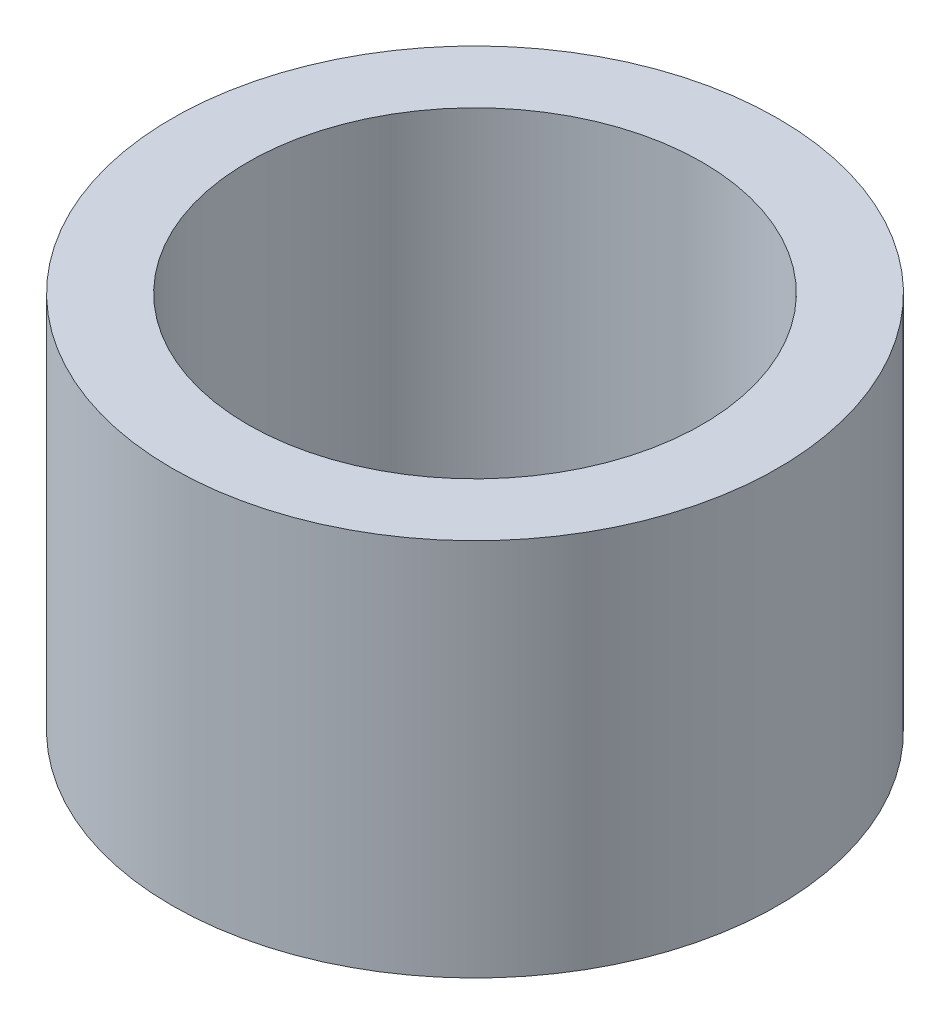
ISO-10303-21;
HEADER;
FILE_DESCRIPTION(('STEP AP214'),'2;1');
FILE_NAME('part.step','',(''),(''),'','','');
FILE_SCHEMA(('AUTOMOTIVE_DESIGN { 1 0 10303 214 1 1 1 1 }'));
ENDSEC;
DATA;
#1=APPLICATION_CONTEXT('core data for automotive mechanical design processes');
#2=APPLICATION_PROTOCOL_DEFINITION('international standard','automotive_design',2000,#1);
#3=PRODUCT_CONTEXT('',#1,'mechanical');
#4=PRODUCT('Part','Part','',(#3));
#5=PRODUCT_RELATED_PRODUCT_CATEGORY('part','',(#4));
#6=PRODUCT_DEFINITION_FORMATION('','',#4);
#7=PRODUCT_DEFINITION_CONTEXT('part definition',#1,'design');
#8=PRODUCT_DEFINITION('design','',#6,#7);
#9=PRODUCT_DEFINITION_SHAPE('','',#8);
#10=(LENGTH_UNIT() NAMED_UNIT(*) SI_UNIT(.MILLI.,.METRE.));
#11=(NAMED_UNIT(*) PLANE_ANGLE_UNIT() SI_UNIT($,.RADIAN.));
#12=(NAMED_UNIT(*) SI_UNIT($,.STERADIAN.) SOLID_ANGLE_UNIT());
#13=UNCERTAINTY_MEASURE_WITH_UNIT(LENGTH_MEASURE(1.E-05),#10,'distance_accuracy_value','');
#14=(GEOMETRIC_REPRESENTATION_CONTEXT(3) GLOBAL_UNCERTAINTY_ASSIGNED_CONTEXT((#13)) GLOBAL_UNIT_ASSIGNED_CONTEXT((#10,
#11,#12)) REPRESENTATION_CONTEXT('',''));
#15=CARTESIAN_POINT('',(0.,0.,0.));
#16=DIRECTION('',(0.,0.,1.));
#17=DIRECTION('',(1.,0.,0.));
#18=AXIS2_PLACEMENT_3D('',#15,#16,#17);
#19=CARTESIAN_POINT('',(0.,10.,0.));
#20=DIRECTION('',(0.,1.,0.));
#21=DIRECTION('',(0.,0.,1.));
#22=AXIS2_PLACEMENT_3D('',#19,#20,#21);
#23=PLANE('',#22);
#24=CARTESIAN_POINT('',(0.,10.,0.));
#25=DIRECTION('',(0.,1.,0.));
#26=DIRECTION('',(0.,0.,1.));
#27=AXIS2_PLACEMENT_3D('',#24,#25,#26);
#28=CIRCLE('',#27,8.);
#29=CARTESIAN_POINT('',(0.,10.,8.));
#30=VERTEX_POINT('',#29);
#31=EDGE_CURVE('E10',#30,#30,#28,.T.);
#32=ORIENTED_EDGE('',*,*,#31,.T.);
#33=EDGE_LOOP('',(#32));
#34=FACE_BOUND('',#33,.T.);
#35=CARTESIAN_POINT('',(0.,10.,0.));
#36=DIRECTION('',(0.,1.,0.));
#37=DIRECTION('',(0.,0.,1.));
#38=AXIS2_PLACEMENT_3D('',#35,#36,#37);
#39=CIRCLE('',#38,6.);
#40=CARTESIAN_POINT('',(0.,10.,6.));
#41=VERTEX_POINT('',#40);
#42=EDGE_CURVE('E43',#41,#41,#39,.T.);
#43=ORIENTED_EDGE('',*,*,#42,.F.);
#44=EDGE_LOOP('',(#43));
#45=FACE_BOUND('',#44,.T.);
#46=ADVANCED_FACE('F32',(#34,#45),#23,.T.);
#47=CARTESIAN_POINT('',(0.,0.,0.));
#48=DIRECTION('',(0.,1.,0.));
#49=DIRECTION('',(0.,0.,1.));
#50=AXIS2_PLACEMENT_3D('',#47,#48,#49);
#51=PLANE('',#50);
#52=CARTESIAN_POINT('',(0.,0.,0.));
#53=DIRECTION('',(0.,1.,0.));
#54=DIRECTION('',(0.,0.,1.));
#55=AXIS2_PLACEMENT_3D('',#52,#53,#54);
#56=CIRCLE('',#55,8.);
#57=CARTESIAN_POINT('',(0.,0.,8.));
#58=VERTEX_POINT('',#57);
#59=EDGE_CURVE('E36',#58,#58,#56,.T.);
#60=ORIENTED_EDGE('',*,*,#59,.F.);
#61=EDGE_LOOP('',(#60));
#62=FACE_BOUND('',#61,.T.);
#63=CARTESIAN_POINT('',(0.,0.,0.));
#64=DIRECTION('',(0.,1.,0.));
#65=DIRECTION('',(0.,0.,1.));
#66=AXIS2_PLACEMENT_3D('',#63,#64,#65);
#67=CIRCLE('',#66,6.);
#68=CARTESIAN_POINT('',(0.,0.,6.));
#69=VERTEX_POINT('',#68);
#70=EDGE_CURVE('E45',#69,#69,#67,.T.);
#71=ORIENTED_EDGE('',*,*,#70,.T.);
#72=EDGE_LOOP('',(#71));
#73=FACE_BOUND('',#72,.T.);
#74=ADVANCED_FACE('F55',(#62,#73),#51,.F.);
#75=CARTESIAN_POINT('',(0.,10.,0.));
#76=DIRECTION('',(0.,-1.,0.));
#77=DIRECTION('',(0.,0.,-1.));
#78=AXIS2_PLACEMENT_3D('',#75,#76,#77);
#79=CYLINDRICAL_SURFACE('',#78,8.);
#80=ORIENTED_EDGE('',*,*,#31,.F.);
#81=EDGE_LOOP('',(#80));
#82=FACE_BOUND('',#81,.T.);
#83=ORIENTED_EDGE('',*,*,#59,.T.);
#84=EDGE_LOOP('',(#83));
#85=FACE_BOUND('',#84,.T.);
#86=ADVANCED_FACE('F34',(#82,#85),#79,.T.);
#87=CARTESIAN_POINT('',(0.,10.,0.));
#88=DIRECTION('',(0.,-1.,0.));
#89=DIRECTION('',(0.,0.,-1.));
#90=AXIS2_PLACEMENT_3D('',#87,#88,#89);
#91=CYLINDRICAL_SURFACE('',#90,6.);
#92=ORIENTED_EDGE('',*,*,#42,.T.);
#93=EDGE_LOOP('',(#92));
#94=FACE_BOUND('',#93,.T.);
#95=ORIENTED_EDGE('',*,*,#70,.F.);
#96=EDGE_LOOP('',(#95));
#97=FACE_BOUND('',#96,.T.);
#98=ADVANCED_FACE('F51',(#94,#97),#91,.F.);
#99=CLOSED_SHELL('',(#46,#74,#86,#98));
#100=MANIFOLD_SOLID_BREP('B2',#99);
#101=ADVANCED_BREP_SHAPE_REPRESENTATION('',(#18,#100),#14);
#102=SHAPE_DEFINITION_REPRESENTATION(#9,#101);
ENDSEC;
END-ISO-10303-21;
